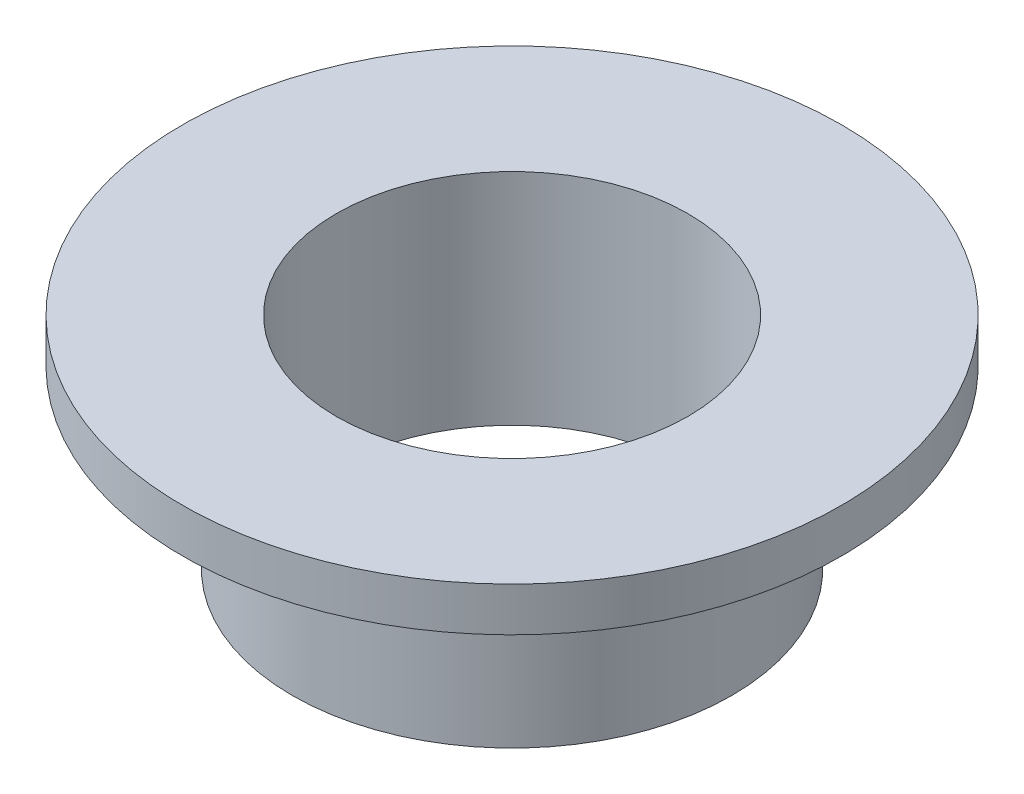
ISO-10303-21;
HEADER;
FILE_DESCRIPTION(('STEP AP214'),'2;1');
FILE_NAME('part.step','',(''),(''),'','','');
FILE_SCHEMA(('AUTOMOTIVE_DESIGN { 1 0 10303 214 1 1 1 1 }'));
ENDSEC;
DATA;
#1=APPLICATION_CONTEXT('core data for automotive mechanical design processes');
#2=APPLICATION_PROTOCOL_DEFINITION('international standard','automotive_design',2000,#1);
#3=PRODUCT_CONTEXT('',#1,'mechanical');
#4=PRODUCT('Part','Part','',(#3));
#5=PRODUCT_RELATED_PRODUCT_CATEGORY('part','',(#4));
#6=PRODUCT_DEFINITION_FORMATION('','',#4);
#7=PRODUCT_DEFINITION_CONTEXT('part definition',#1,'design');
#8=PRODUCT_DEFINITION('design','',#6,#7);
#9=PRODUCT_DEFINITION_SHAPE('','',#8);
#10=(LENGTH_UNIT() NAMED_UNIT(*) SI_UNIT(.MILLI.,.METRE.));
#11=(NAMED_UNIT(*) PLANE_ANGLE_UNIT() SI_UNIT($,.RADIAN.));
#12=(NAMED_UNIT(*) SI_UNIT($,.STERADIAN.) SOLID_ANGLE_UNIT());
#13=UNCERTAINTY_MEASURE_WITH_UNIT(LENGTH_MEASURE(1.E-05),#10,'distance_accuracy_value','');
#14=(GEOMETRIC_REPRESENTATION_CONTEXT(3) GLOBAL_UNCERTAINTY_ASSIGNED_CONTEXT((#13)) GLOBAL_UNIT_ASSIGNED_CONTEXT((#10,
#11,#12)) REPRESENTATION_CONTEXT('',''));
#15=CARTESIAN_POINT('',(0.,0.,0.));
#16=DIRECTION('',(0.,0.,1.));
#17=DIRECTION('',(1.,0.,0.));
#18=AXIS2_PLACEMENT_3D('',#15,#16,#17);
#19=CARTESIAN_POINT('',(0.,0.,0.));
#20=DIRECTION('',(0.,-1.,0.));
#21=DIRECTION('',(0.,0.,-1.));
#22=AXIS2_PLACEMENT_3D('',#19,#20,#21);
#23=CYLINDRICAL_SURFACE('',#22,4.);
#24=CARTESIAN_POINT('',(0.,5.,0.));
#25=DIRECTION('',(0.,-1.,0.));
#26=DIRECTION('',(0.,0.,-1.));
#27=AXIS2_PLACEMENT_3D('',#24,#25,#26);
#28=CIRCLE('',#27,4.);
#29=CARTESIAN_POINT('',(0.,5.,-4.));
#30=VERTEX_POINT('',#29);
#31=EDGE_CURVE('E10',#30,#30,#28,.T.);
#32=ORIENTED_EDGE('',*,*,#31,.F.);
#33=EDGE_LOOP('',(#32));
#34=FACE_BOUND('',#33,.T.);
#35=CARTESIAN_POINT('',(0.,0.,0.));
#36=DIRECTION('',(0.,-1.,0.));
#37=DIRECTION('',(0.,0.,-1.));
#38=AXIS2_PLACEMENT_3D('',#35,#36,#37);
#39=CIRCLE('',#38,4.);
#40=CARTESIAN_POINT('',(0.,0.,-4.));
#41=VERTEX_POINT('',#40);
#42=EDGE_CURVE('E51',#41,#41,#39,.T.);
#43=ORIENTED_EDGE('',*,*,#42,.T.);
#44=EDGE_LOOP('',(#43));
#45=FACE_BOUND('',#44,.T.);
#46=ADVANCED_FACE('F29',(#34,#45),#23,.F.);
#47=CARTESIAN_POINT('',(-4.,5.,0.));
#48=DIRECTION('',(0.,-1.,0.));
#49=DIRECTION('',(0.,0.,-1.));
#50=AXIS2_PLACEMENT_3D('',#47,#48,#49);
#51=PLANE('',#50);
#52=CARTESIAN_POINT('',(0.,5.,0.));
#53=DIRECTION('',(0.,-1.,0.));
#54=DIRECTION('',(0.,0.,-1.));
#55=AXIS2_PLACEMENT_3D('',#52,#53,#54);
#56=CIRCLE('',#55,7.5);
#57=CARTESIAN_POINT('',(0.,5.,-7.5));
#58=VERTEX_POINT('',#57);
#59=EDGE_CURVE('E35',#58,#58,#56,.T.);
#60=ORIENTED_EDGE('',*,*,#59,.F.);
#61=EDGE_LOOP('',(#60));
#62=FACE_BOUND('',#61,.T.);
#63=ORIENTED_EDGE('',*,*,#31,.T.);
#64=EDGE_LOOP('',(#63));
#65=FACE_BOUND('',#64,.T.);
#66=ADVANCED_FACE('F76',(#62,#65),#51,.F.);
#67=CARTESIAN_POINT('',(0.,0.,0.));
#68=DIRECTION('',(0.,-1.,0.));
#69=DIRECTION('',(0.,0.,-1.));
#70=AXIS2_PLACEMENT_3D('',#67,#68,#69);
#71=CYLINDRICAL_SURFACE('',#70,7.5);
#72=CARTESIAN_POINT('',(0.,4.,0.));
#73=DIRECTION('',(0.,-1.,0.));
#74=DIRECTION('',(0.,0.,-1.));
#75=AXIS2_PLACEMENT_3D('',#72,#73,#74);
#76=CIRCLE('',#75,7.5);
#77=CARTESIAN_POINT('',(0.,4.,-7.5));
#78=VERTEX_POINT('',#77);
#79=EDGE_CURVE('E39',#78,#78,#76,.T.);
#80=ORIENTED_EDGE('',*,*,#79,.F.);
#81=EDGE_LOOP('',(#80));
#82=FACE_BOUND('',#81,.T.);
#83=ORIENTED_EDGE('',*,*,#59,.T.);
#84=EDGE_LOOP('',(#83));
#85=FACE_BOUND('',#84,.T.);
#86=ADVANCED_FACE('F71',(#82,#85),#71,.T.);
#87=CARTESIAN_POINT('',(-7.5,4.,0.));
#88=DIRECTION('',(0.,1.,0.));
#89=DIRECTION('',(0.,0.,1.));
#90=AXIS2_PLACEMENT_3D('',#87,#88,#89);
#91=PLANE('',#90);
#92=CARTESIAN_POINT('',(0.,4.,0.));
#93=DIRECTION('',(0.,-1.,0.));
#94=DIRECTION('',(0.,0.,-1.));
#95=AXIS2_PLACEMENT_3D('',#92,#93,#94);
#96=CIRCLE('',#95,5.);
#97=CARTESIAN_POINT('',(0.,4.,-5.));
#98=VERTEX_POINT('',#97);
#99=EDGE_CURVE('E43',#98,#98,#96,.T.);
#100=ORIENTED_EDGE('',*,*,#99,.F.);
#101=EDGE_LOOP('',(#100));
#102=FACE_BOUND('',#101,.T.);
#103=ORIENTED_EDGE('',*,*,#79,.T.);
#104=EDGE_LOOP('',(#103));
#105=FACE_BOUND('',#104,.T.);
#106=ADVANCED_FACE('F65',(#102,#105),#91,.F.);
#107=CARTESIAN_POINT('',(0.,0.,0.));
#108=DIRECTION('',(0.,-1.,0.));
#109=DIRECTION('',(0.,0.,-1.));
#110=AXIS2_PLACEMENT_3D('',#107,#108,#109);
#111=CYLINDRICAL_SURFACE('',#110,5.);
#112=CARTESIAN_POINT('',(0.,0.,0.));
#113=DIRECTION('',(0.,-1.,0.));
#114=DIRECTION('',(0.,0.,-1.));
#115=AXIS2_PLACEMENT_3D('',#112,#113,#114);
#116=CIRCLE('',#115,5.);
#117=CARTESIAN_POINT('',(0.,0.,-5.));
#118=VERTEX_POINT('',#117);
#119=EDGE_CURVE('E48',#118,#118,#116,.T.);
#120=ORIENTED_EDGE('',*,*,#119,.F.);
#121=EDGE_LOOP('',(#120));
#122=FACE_BOUND('',#121,.T.);
#123=ORIENTED_EDGE('',*,*,#99,.T.);
#124=EDGE_LOOP('',(#123));
#125=FACE_BOUND('',#124,.T.);
#126=ADVANCED_FACE('F59',(#122,#125),#111,.T.);
#127=CARTESIAN_POINT('',(-5.,0.,0.));
#128=DIRECTION('',(0.,1.,0.));
#129=DIRECTION('',(0.,0.,1.));
#130=AXIS2_PLACEMENT_3D('',#127,#128,#129);
#131=PLANE('',#130);
#132=ORIENTED_EDGE('',*,*,#42,.F.);
#133=EDGE_LOOP('',(#132));
#134=FACE_BOUND('',#133,.T.);
#135=ORIENTED_EDGE('',*,*,#119,.T.);
#136=EDGE_LOOP('',(#135));
#137=FACE_BOUND('',#136,.T.);
#138=ADVANCED_FACE('F56',(#134,#137),#131,.F.);
#139=CLOSED_SHELL('',(#46,#66,#86,#106,#126,#138));
#140=MANIFOLD_SOLID_BREP('B2',#139);
#141=ADVANCED_BREP_SHAPE_REPRESENTATION('',(#18,#140),#14);
#142=SHAPE_DEFINITION_REPRESENTATION(#9,#141);
ENDSEC;
END-ISO-10303-21;
